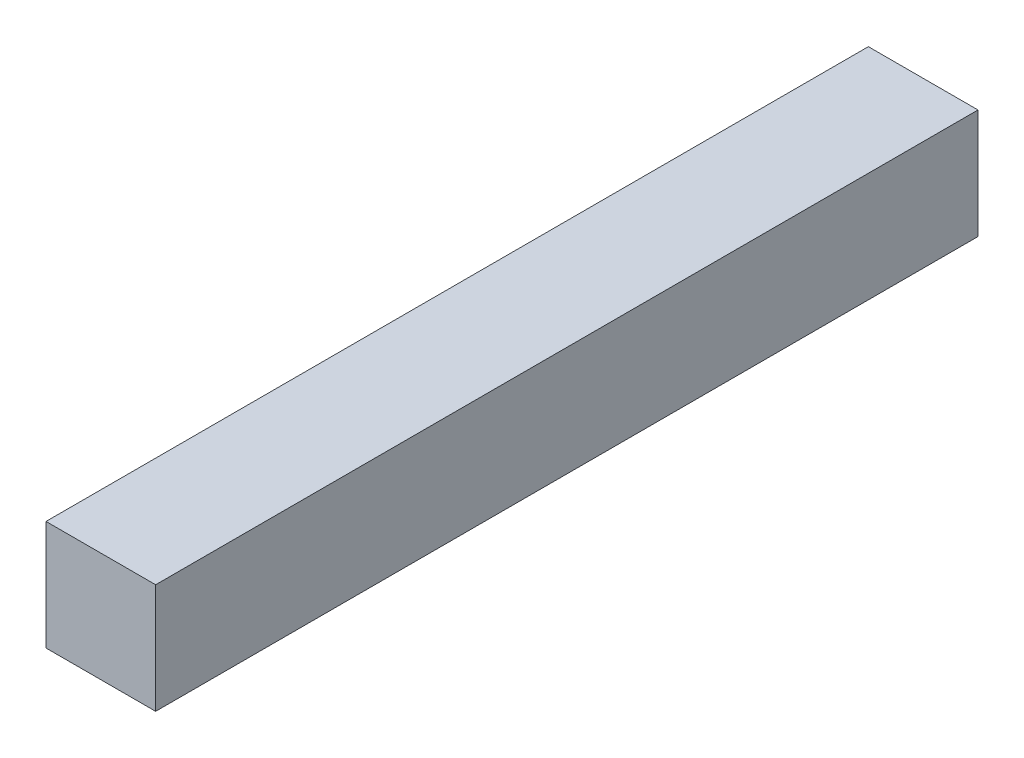
ISO-10303-21;
HEADER;
FILE_DESCRIPTION(('STEP AP214'),'2;1');
FILE_NAME('part.step','',(''),(''),'','','');
FILE_SCHEMA(('AUTOMOTIVE_DESIGN { 1 0 10303 214 1 1 1 1 }'));
ENDSEC;
DATA;
#1=APPLICATION_CONTEXT('core data for automotive mechanical design processes');
#2=APPLICATION_PROTOCOL_DEFINITION('international standard','automotive_design',2000,#1);
#3=PRODUCT_CONTEXT('',#1,'mechanical');
#4=PRODUCT('Part','Part','',(#3));
#5=PRODUCT_RELATED_PRODUCT_CATEGORY('part','',(#4));
#6=PRODUCT_DEFINITION_FORMATION('','',#4);
#7=PRODUCT_DEFINITION_CONTEXT('part definition',#1,'design');
#8=PRODUCT_DEFINITION('design','',#6,#7);
#9=PRODUCT_DEFINITION_SHAPE('','',#8);
#10=(LENGTH_UNIT() NAMED_UNIT(*) SI_UNIT(.MILLI.,.METRE.));
#11=(NAMED_UNIT(*) PLANE_ANGLE_UNIT() SI_UNIT($,.RADIAN.));
#12=(NAMED_UNIT(*) SI_UNIT($,.STERADIAN.) SOLID_ANGLE_UNIT());
#13=UNCERTAINTY_MEASURE_WITH_UNIT(LENGTH_MEASURE(1.E-05),#10,'distance_accuracy_value','');
#14=(GEOMETRIC_REPRESENTATION_CONTEXT(3) GLOBAL_UNCERTAINTY_ASSIGNED_CONTEXT((#13)) GLOBAL_UNIT_ASSIGNED_CONTEXT((#10,
#11,#12)) REPRESENTATION_CONTEXT('',''));
#15=CARTESIAN_POINT('',(0.,0.,0.));
#16=DIRECTION('',(0.,0.,1.));
#17=DIRECTION('',(1.,0.,0.));
#18=AXIS2_PLACEMENT_3D('',#15,#16,#17);
#19=CARTESIAN_POINT('',(10.16,-10.16,76.2));
#20=DIRECTION('',(-1.,0.,0.));
#21=DIRECTION('',(0.,0.,1.));
#22=AXIS2_PLACEMENT_3D('',#19,#20,#21);
#23=PLANE('',#22);
#24=DIRECTION('',(0.,1.,0.));
#25=VECTOR('',#24,1.);
#26=CARTESIAN_POINT('',(10.16,-10.16,-76.2));
#27=LINE('',#26,#25);
#28=CARTESIAN_POINT('',(10.16,-10.16,-76.2));
#29=VERTEX_POINT('',#28);
#30=CARTESIAN_POINT('',(10.16,10.16,-76.2));
#31=VERTEX_POINT('',#30);
#32=EDGE_CURVE('E102',#29,#31,#27,.T.);
#33=ORIENTED_EDGE('',*,*,#32,.T.);
#34=DIRECTION('',(0.,0.,-1.));
#35=VECTOR('',#34,1.);
#36=CARTESIAN_POINT('',(10.16,10.16,76.2));
#37=LINE('',#36,#35);
#38=CARTESIAN_POINT('',(10.16,10.16,76.2));
#39=VERTEX_POINT('',#38);
#40=EDGE_CURVE('E11',#39,#31,#37,.T.);
#41=ORIENTED_EDGE('',*,*,#40,.F.);
#42=DIRECTION('',(0.,1.,0.));
#43=VECTOR('',#42,1.);
#44=CARTESIAN_POINT('',(10.16,-10.16,76.2));
#45=LINE('',#44,#43);
#46=CARTESIAN_POINT('',(10.16,-10.16,76.2));
#47=VERTEX_POINT('',#46);
#48=EDGE_CURVE('E90',#47,#39,#45,.T.);
#49=ORIENTED_EDGE('',*,*,#48,.F.);
#50=DIRECTION('',(0.,0.,-1.));
#51=VECTOR('',#50,1.);
#52=CARTESIAN_POINT('',(10.16,-10.16,76.2));
#53=LINE('',#52,#51);
#54=EDGE_CURVE('E98',#47,#29,#53,.T.);
#55=ORIENTED_EDGE('',*,*,#54,.T.);
#56=EDGE_LOOP('',(#33,#41,#49,#55));
#57=FACE_BOUND('',#56,.T.);
#58=ADVANCED_FACE('F39',(#57),#23,.F.);
#59=CARTESIAN_POINT('',(-10.16,10.16,76.2));
#60=DIRECTION('',(0.,-1.,0.));
#61=DIRECTION('',(0.,0.,-1.));
#62=AXIS2_PLACEMENT_3D('',#59,#60,#61);
#63=PLANE('',#62);
#64=DIRECTION('',(-1.,0.,0.));
#65=VECTOR('',#64,1.);
#66=CARTESIAN_POINT('',(-10.16,10.16,-76.2));
#67=LINE('',#66,#65);
#68=CARTESIAN_POINT('',(-10.16,10.16,-76.2));
#69=VERTEX_POINT('',#68);
#70=EDGE_CURVE('E94',#31,#69,#67,.T.);
#71=ORIENTED_EDGE('',*,*,#70,.T.);
#72=DIRECTION('',(0.,0.,-1.));
#73=VECTOR('',#72,1.);
#74=CARTESIAN_POINT('',(-10.16,10.16,76.2));
#75=LINE('',#74,#73);
#76=CARTESIAN_POINT('',(-10.16,10.16,76.2));
#77=VERTEX_POINT('',#76);
#78=EDGE_CURVE('E47',#77,#69,#75,.T.);
#79=ORIENTED_EDGE('',*,*,#78,.F.);
#80=DIRECTION('',(-1.,0.,0.));
#81=VECTOR('',#80,1.);
#82=CARTESIAN_POINT('',(-10.16,10.16,76.2));
#83=LINE('',#82,#81);
#84=EDGE_CURVE('E85',#39,#77,#83,.T.);
#85=ORIENTED_EDGE('',*,*,#84,.F.);
#86=ORIENTED_EDGE('',*,*,#40,.T.);
#87=EDGE_LOOP('',(#71,#79,#85,#86));
#88=FACE_BOUND('',#87,.T.);
#89=ADVANCED_FACE('F93',(#88),#63,.F.);
#90=CARTESIAN_POINT('',(-10.16,-10.16,76.2));
#91=DIRECTION('',(1.,0.,0.));
#92=DIRECTION('',(0.,0.,-1.));
#93=AXIS2_PLACEMENT_3D('',#90,#91,#92);
#94=PLANE('',#93);
#95=DIRECTION('',(0.,-1.,0.));
#96=VECTOR('',#95,1.);
#97=CARTESIAN_POINT('',(-10.16,-10.16,-76.2));
#98=LINE('',#97,#96);
#99=CARTESIAN_POINT('',(-10.16,-10.16,-76.2));
#100=VERTEX_POINT('',#99);
#101=EDGE_CURVE('E72',#69,#100,#98,.T.);
#102=ORIENTED_EDGE('',*,*,#101,.T.);
#103=DIRECTION('',(0.,0.,-1.));
#104=VECTOR('',#103,1.);
#105=CARTESIAN_POINT('',(-10.16,-10.16,76.2));
#106=LINE('',#105,#104);
#107=CARTESIAN_POINT('',(-10.16,-10.16,76.2));
#108=VERTEX_POINT('',#107);
#109=EDGE_CURVE('E95',#108,#100,#106,.T.);
#110=ORIENTED_EDGE('',*,*,#109,.F.);
#111=DIRECTION('',(0.,-1.,0.));
#112=VECTOR('',#111,1.);
#113=CARTESIAN_POINT('',(-10.16,-10.16,76.2));
#114=LINE('',#113,#112);
#115=EDGE_CURVE('E88',#77,#108,#114,.T.);
#116=ORIENTED_EDGE('',*,*,#115,.F.);
#117=ORIENTED_EDGE('',*,*,#78,.T.);
#118=EDGE_LOOP('',(#102,#110,#116,#117));
#119=FACE_BOUND('',#118,.T.);
#120=ADVANCED_FACE('F96',(#119),#94,.F.);
#121=CARTESIAN_POINT('',(-10.16,-10.16,76.2));
#122=DIRECTION('',(0.,1.,0.));
#123=DIRECTION('',(0.,0.,1.));
#124=AXIS2_PLACEMENT_3D('',#121,#122,#123);
#125=PLANE('',#124);
#126=DIRECTION('',(1.,0.,0.));
#127=VECTOR('',#126,1.);
#128=CARTESIAN_POINT('',(-10.16,-10.16,-76.2));
#129=LINE('',#128,#127);
#130=EDGE_CURVE('E78',#100,#29,#129,.T.);
#131=ORIENTED_EDGE('',*,*,#130,.T.);
#132=ORIENTED_EDGE('',*,*,#54,.F.);
#133=DIRECTION('',(1.,0.,0.));
#134=VECTOR('',#133,1.);
#135=CARTESIAN_POINT('',(-10.16,-10.16,76.2));
#136=LINE('',#135,#134);
#137=EDGE_CURVE('E55',#108,#47,#136,.T.);
#138=ORIENTED_EDGE('',*,*,#137,.F.);
#139=ORIENTED_EDGE('',*,*,#109,.T.);
#140=EDGE_LOOP('',(#131,#132,#138,#139));
#141=FACE_BOUND('',#140,.T.);
#142=ADVANCED_FACE('F109',(#141),#125,.F.);
#143=CARTESIAN_POINT('',(0.,0.,76.2));
#144=DIRECTION('',(0.,0.,-1.));
#145=DIRECTION('',(-1.,0.,0.));
#146=AXIS2_PLACEMENT_3D('',#143,#144,#145);
#147=PLANE('',#146);
#148=ORIENTED_EDGE('',*,*,#48,.T.);
#149=ORIENTED_EDGE('',*,*,#84,.T.);
#150=ORIENTED_EDGE('',*,*,#115,.T.);
#151=ORIENTED_EDGE('',*,*,#137,.T.);
#152=EDGE_LOOP('',(#148,#149,#150,#151));
#153=FACE_BOUND('',#152,.T.);
#154=ADVANCED_FACE('F86',(#153),#147,.F.);
#155=CARTESIAN_POINT('',(0.,0.,-76.2));
#156=DIRECTION('',(0.,0.,-1.));
#157=DIRECTION('',(-1.,0.,0.));
#158=AXIS2_PLACEMENT_3D('',#155,#156,#157);
#159=PLANE('',#158);
#160=ORIENTED_EDGE('',*,*,#32,.F.);
#161=ORIENTED_EDGE('',*,*,#130,.F.);
#162=ORIENTED_EDGE('',*,*,#101,.F.);
#163=ORIENTED_EDGE('',*,*,#70,.F.);
#164=EDGE_LOOP('',(#160,#161,#162,#163));
#165=FACE_BOUND('',#164,.T.);
#166=ADVANCED_FACE('F112',(#165),#159,.T.);
#167=CLOSED_SHELL('',(#58,#89,#120,#142,#154,#166));
#168=MANIFOLD_SOLID_BREP('B2',#167);
#169=ADVANCED_BREP_SHAPE_REPRESENTATION('',(#18,#168),#14);
#170=SHAPE_DEFINITION_REPRESENTATION(#9,#169);
ENDSEC;
END-ISO-10303-21;
